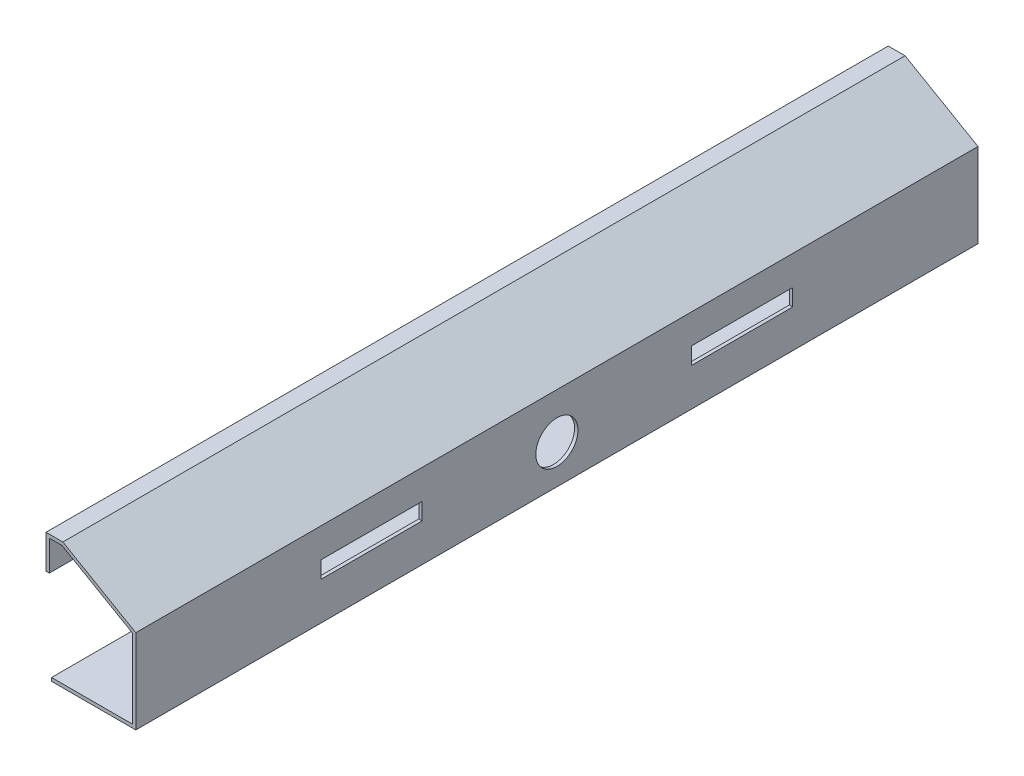
ISO-10303-21;
HEADER;
FILE_DESCRIPTION(('STEP AP214'),'2;1');
FILE_NAME('part.step','',(''),(''),'','','');
FILE_SCHEMA(('AUTOMOTIVE_DESIGN { 1 0 10303 214 1 1 1 1 }'));
ENDSEC;
DATA;
#1=APPLICATION_CONTEXT('core data for automotive mechanical design processes');
#2=APPLICATION_PROTOCOL_DEFINITION('international standard','automotive_design',2000,#1);
#3=PRODUCT_CONTEXT('',#1,'mechanical');
#4=PRODUCT('Part','Part','',(#3));
#5=PRODUCT_RELATED_PRODUCT_CATEGORY('part','',(#4));
#6=PRODUCT_DEFINITION_FORMATION('','',#4);
#7=PRODUCT_DEFINITION_CONTEXT('part definition',#1,'design');
#8=PRODUCT_DEFINITION('design','',#6,#7);
#9=PRODUCT_DEFINITION_SHAPE('','',#8);
#10=(LENGTH_UNIT() NAMED_UNIT(*) SI_UNIT(.MILLI.,.METRE.));
#11=(NAMED_UNIT(*) PLANE_ANGLE_UNIT() SI_UNIT($,.RADIAN.));
#12=(NAMED_UNIT(*) SI_UNIT($,.STERADIAN.) SOLID_ANGLE_UNIT());
#13=UNCERTAINTY_MEASURE_WITH_UNIT(LENGTH_MEASURE(1.E-05),#10,'distance_accuracy_value','');
#14=(GEOMETRIC_REPRESENTATION_CONTEXT(3) GLOBAL_UNCERTAINTY_ASSIGNED_CONTEXT((#13)) GLOBAL_UNIT_ASSIGNED_CONTEXT((#10,
#11,#12)) REPRESENTATION_CONTEXT('',''));
#15=CARTESIAN_POINT('',(0.,0.,0.));
#16=DIRECTION('',(0.,0.,1.));
#17=DIRECTION('',(1.,0.,0.));
#18=AXIS2_PLACEMENT_3D('',#15,#16,#17);
#19=CARTESIAN_POINT('',(0.,0.,500.));
#20=DIRECTION('',(-1.,0.,0.));
#21=DIRECTION('',(0.,-1.,0.));
#22=AXIS2_PLACEMENT_3D('',#19,#20,#21);
#23=PLANE('',#22);
#24=DIRECTION('',(0.,0.,1.));
#25=VECTOR('',#24,1.);
#26=CARTESIAN_POINT('',(0.,-17.5,390.));
#27=LINE('',#26,#25);
#28=CARTESIAN_POINT('',(0.,-17.5,330.));
#29=VERTEX_POINT('',#28);
#30=CARTESIAN_POINT('',(0.,-17.5,390.));
#31=VERTEX_POINT('',#30);
#32=EDGE_CURVE('E233',#29,#31,#27,.T.);
#33=ORIENTED_EDGE('',*,*,#32,.F.);
#34=DIRECTION('',(0.,1.,0.));
#35=VECTOR('',#34,1.);
#36=CARTESIAN_POINT('',(0.,-27.5,330.));
#37=LINE('',#36,#35);
#38=CARTESIAN_POINT('',(0.,-27.5,330.));
#39=VERTEX_POINT('',#38);
#40=EDGE_CURVE('E230',#39,#29,#37,.T.);
#41=ORIENTED_EDGE('',*,*,#40,.F.);
#42=DIRECTION('',(0.,0.,-1.));
#43=VECTOR('',#42,1.);
#44=CARTESIAN_POINT('',(0.,-27.5,390.));
#45=LINE('',#44,#43);
#46=CARTESIAN_POINT('',(0.,-27.5,390.));
#47=VERTEX_POINT('',#46);
#48=EDGE_CURVE('E217',#47,#39,#45,.T.);
#49=ORIENTED_EDGE('',*,*,#48,.F.);
#50=DIRECTION('',(0.,-1.,0.));
#51=VECTOR('',#50,1.);
#52=CARTESIAN_POINT('',(0.,-27.5,390.));
#53=LINE('',#52,#51);
#54=EDGE_CURVE('E238',#31,#47,#53,.T.);
#55=ORIENTED_EDGE('',*,*,#54,.F.);
#56=EDGE_LOOP('',(#33,#41,#49,#55));
#57=FACE_BOUND('',#56,.T.);
#58=DIRECTION('',(0.,0.,1.));
#59=VECTOR('',#58,1.);
#60=CARTESIAN_POINT('',(0.,-17.5,110.));
#61=LINE('',#60,#59);
#62=CARTESIAN_POINT('',(0.,-17.5,110.));
#63=VERTEX_POINT('',#62);
#64=CARTESIAN_POINT('',(0.,-17.5,170.));
#65=VERTEX_POINT('',#64);
#66=EDGE_CURVE('E278',#63,#65,#61,.T.);
#67=ORIENTED_EDGE('',*,*,#66,.F.);
#68=DIRECTION('',(0.,1.,0.));
#69=VECTOR('',#68,1.);
#70=CARTESIAN_POINT('',(0.,-27.4999999999999,110.));
#71=LINE('',#70,#69);
#72=CARTESIAN_POINT('',(0.,-27.4999999999999,110.));
#73=VERTEX_POINT('',#72);
#74=EDGE_CURVE('E211',#73,#63,#71,.T.);
#75=ORIENTED_EDGE('',*,*,#74,.F.);
#76=DIRECTION('',(0.,0.,-1.));
#77=VECTOR('',#76,1.);
#78=CARTESIAN_POINT('',(0.,-27.4999999999999,110.));
#79=LINE('',#78,#77);
#80=CARTESIAN_POINT('',(0.,-27.5,170.));
#81=VERTEX_POINT('',#80);
#82=EDGE_CURVE('E263',#81,#73,#79,.T.);
#83=ORIENTED_EDGE('',*,*,#82,.F.);
#84=DIRECTION('',(0.,-1.,0.));
#85=VECTOR('',#84,1.);
#86=CARTESIAN_POINT('',(0.,-27.5,170.));
#87=LINE('',#86,#85);
#88=EDGE_CURVE('E282',#65,#81,#87,.T.);
#89=ORIENTED_EDGE('',*,*,#88,.F.);
#90=EDGE_LOOP('',(#67,#75,#83,#89));
#91=FACE_BOUND('',#90,.T.);
#92=CARTESIAN_POINT('',(0.,-27.,250.));
#93=DIRECTION('',(1.,0.,0.));
#94=DIRECTION('',(0.,0.,-1.));
#95=AXIS2_PLACEMENT_3D('',#92,#93,#94);
#96=CIRCLE('',#95,12.5);
#97=CARTESIAN_POINT('',(0.,-27.,237.5));
#98=VERTEX_POINT('',#97);
#99=EDGE_CURVE('E248',#98,#98,#96,.T.);
#100=ORIENTED_EDGE('',*,*,#99,.F.);
#101=EDGE_LOOP('',(#100));
#102=FACE_BOUND('',#101,.T.);
#103=DIRECTION('',(0.,1.,0.));
#104=VECTOR('',#103,1.);
#105=CARTESIAN_POINT('',(0.,0.,0.));
#106=LINE('',#105,#104);
#107=CARTESIAN_POINT('',(0.,-50.,0.));
#108=VERTEX_POINT('',#107);
#109=CARTESIAN_POINT('',(0.,0.,0.));
#110=VERTEX_POINT('',#109);
#111=EDGE_CURVE('E335',#108,#110,#106,.T.);
#112=ORIENTED_EDGE('',*,*,#111,.T.);
#113=DIRECTION('',(0.,0.,-1.));
#114=VECTOR('',#113,1.);
#115=CARTESIAN_POINT('',(0.,0.,500.));
#116=LINE('',#115,#114);
#117=CARTESIAN_POINT('',(0.,0.,500.));
#118=VERTEX_POINT('',#117);
#119=EDGE_CURVE('E11',#118,#110,#116,.T.);
#120=ORIENTED_EDGE('',*,*,#119,.F.);
#121=DIRECTION('',(0.,1.,0.));
#122=VECTOR('',#121,1.);
#123=CARTESIAN_POINT('',(0.,0.,500.));
#124=LINE('',#123,#122);
#125=CARTESIAN_POINT('',(0.,-50.,500.));
#126=VERTEX_POINT('',#125);
#127=EDGE_CURVE('E303',#126,#118,#124,.T.);
#128=ORIENTED_EDGE('',*,*,#127,.F.);
#129=DIRECTION('',(0.,0.,-1.));
#130=VECTOR('',#129,1.);
#131=CARTESIAN_POINT('',(0.,-50.,500.));
#132=LINE('',#131,#130);
#133=EDGE_CURVE('E334',#126,#108,#132,.T.);
#134=ORIENTED_EDGE('',*,*,#133,.T.);
#135=EDGE_LOOP('',(#112,#120,#128,#134));
#136=FACE_BOUND('',#135,.T.);
#137=ADVANCED_FACE('F39',(#57,#91,#102,#136),#23,.F.);
#138=CARTESIAN_POINT('',(0.,0.,500.));
#139=DIRECTION('',(-0.500000000000004,-0.866025403784436,0.));
#140=DIRECTION('',(0.866025403784436,-0.500000000000004,0.));
#141=AXIS2_PLACEMENT_3D('',#138,#139,#140);
#142=PLANE('',#141);
#143=DIRECTION('',(-0.866025403784436,0.500000000000004,0.));
#144=VECTOR('',#143,1.);
#145=CARTESIAN_POINT('',(0.,0.,0.));
#146=LINE('',#145,#144);
#147=CARTESIAN_POINT('',(-43.3012701892218,25.0000000000002,0.));
#148=VERTEX_POINT('',#147);
#149=EDGE_CURVE('E339',#110,#148,#146,.T.);
#150=ORIENTED_EDGE('',*,*,#149,.T.);
#151=DIRECTION('',(0.,0.,-1.));
#152=VECTOR('',#151,1.);
#153=CARTESIAN_POINT('',(-43.3012701892218,25.0000000000002,500.));
#154=LINE('',#153,#152);
#155=CARTESIAN_POINT('',(-43.3012701892218,25.0000000000002,500.));
#156=VERTEX_POINT('',#155);
#157=EDGE_CURVE('E48',#156,#148,#154,.T.);
#158=ORIENTED_EDGE('',*,*,#157,.F.);
#159=DIRECTION('',(-0.866025403784436,0.500000000000004,0.));
#160=VECTOR('',#159,1.);
#161=CARTESIAN_POINT('',(0.,0.,500.));
#162=LINE('',#161,#160);
#163=EDGE_CURVE('E307',#118,#156,#162,.T.);
#164=ORIENTED_EDGE('',*,*,#163,.F.);
#165=ORIENTED_EDGE('',*,*,#119,.T.);
#166=EDGE_LOOP('',(#150,#158,#164,#165));
#167=FACE_BOUND('',#166,.T.);
#168=ADVANCED_FACE('F408',(#167),#142,.F.);
#169=CARTESIAN_POINT('',(-43.3012701892218,25.0000000000002,500.));
#170=DIRECTION('',(0.,-1.,0.));
#171=DIRECTION('',(1.,0.,0.));
#172=AXIS2_PLACEMENT_3D('',#169,#170,#171);
#173=PLANE('',#172);
#174=DIRECTION('',(-1.,0.,0.));
#175=VECTOR('',#174,1.);
#176=CARTESIAN_POINT('',(-43.3012701892218,25.0000000000002,0.));
#177=LINE('',#176,#175);
#178=CARTESIAN_POINT('',(-53.3012701892218,25.0000000000002,0.));
#179=VERTEX_POINT('',#178);
#180=EDGE_CURVE('E342',#148,#179,#177,.T.);
#181=ORIENTED_EDGE('',*,*,#180,.T.);
#182=DIRECTION('',(0.,0.,-1.));
#183=VECTOR('',#182,1.);
#184=CARTESIAN_POINT('',(-53.3012701892218,25.0000000000002,500.));
#185=LINE('',#184,#183);
#186=CARTESIAN_POINT('',(-53.3012701892218,25.0000000000002,500.));
#187=VERTEX_POINT('',#186);
#188=EDGE_CURVE('E387',#187,#179,#185,.T.);
#189=ORIENTED_EDGE('',*,*,#188,.F.);
#190=DIRECTION('',(-1.,0.,0.));
#191=VECTOR('',#190,1.);
#192=CARTESIAN_POINT('',(-43.3012701892218,25.0000000000002,500.));
#193=LINE('',#192,#191);
#194=EDGE_CURVE('E311',#156,#187,#193,.T.);
#195=ORIENTED_EDGE('',*,*,#194,.F.);
#196=ORIENTED_EDGE('',*,*,#157,.T.);
#197=EDGE_LOOP('',(#181,#189,#195,#196));
#198=FACE_BOUND('',#197,.T.);
#199=ADVANCED_FACE('F397',(#198),#173,.F.);
#200=CARTESIAN_POINT('',(-53.3012701892218,25.0000000000002,500.));
#201=DIRECTION('',(1.,0.,0.));
#202=DIRECTION('',(0.,0.,-1.));
#203=AXIS2_PLACEMENT_3D('',#200,#201,#202);
#204=PLANE('',#203);
#205=DIRECTION('',(0.,-1.,0.));
#206=VECTOR('',#205,1.);
#207=CARTESIAN_POINT('',(-53.3012701892218,25.0000000000002,0.));
#208=LINE('',#207,#206);
#209=CARTESIAN_POINT('',(-53.3012701892218,5.00000000000018,0.));
#210=VERTEX_POINT('',#209);
#211=EDGE_CURVE('E345',#179,#210,#208,.T.);
#212=ORIENTED_EDGE('',*,*,#211,.T.);
#213=DIRECTION('',(0.,0.,1.));
#214=VECTOR('',#213,1.);
#215=CARTESIAN_POINT('',(-53.3012701892218,5.00000000000018,0.));
#216=LINE('',#215,#214);
#217=CARTESIAN_POINT('',(-53.3012701892218,5.00000000000018,500.));
#218=VERTEX_POINT('',#217);
#219=EDGE_CURVE('E194',#210,#218,#216,.T.);
#220=ORIENTED_EDGE('',*,*,#219,.T.);
#221=DIRECTION('',(0.,-1.,0.));
#222=VECTOR('',#221,1.);
#223=CARTESIAN_POINT('',(-53.3012701892218,25.0000000000002,500.));
#224=LINE('',#223,#222);
#225=EDGE_CURVE('E314',#187,#218,#224,.T.);
#226=ORIENTED_EDGE('',*,*,#225,.F.);
#227=ORIENTED_EDGE('',*,*,#188,.T.);
#228=EDGE_LOOP('',(#212,#220,#226,#227));
#229=FACE_BOUND('',#228,.T.);
#230=ADVANCED_FACE('F402',(#229),#204,.F.);
#231=CARTESIAN_POINT('',(-43.8371685740841,23.0000000000002,500.));
#232=DIRECTION('',(0.,1.,0.));
#233=DIRECTION('',(0.,0.,1.));
#234=AXIS2_PLACEMENT_3D('',#231,#232,#233);
#235=PLANE('',#234);
#236=DIRECTION('',(1.,0.,0.));
#237=VECTOR('',#236,1.);
#238=CARTESIAN_POINT('',(-43.8371685740841,23.0000000000002,500.));
#239=LINE('',#238,#237);
#240=CARTESIAN_POINT('',(-51.3012701892218,23.0000000000002,500.));
#241=VERTEX_POINT('',#240);
#242=CARTESIAN_POINT('',(-43.8371685740841,23.0000000000002,500.));
#243=VERTEX_POINT('',#242);
#244=EDGE_CURVE('E55',#241,#243,#239,.T.);
#245=ORIENTED_EDGE('',*,*,#244,.F.);
#246=DIRECTION('',(0.,0.,-1.));
#247=VECTOR('',#246,1.);
#248=CARTESIAN_POINT('',(-51.3012701892218,23.0000000000002,500.));
#249=LINE('',#248,#247);
#250=CARTESIAN_POINT('',(-51.3012701892218,23.0000000000002,0.));
#251=VERTEX_POINT('',#250);
#252=EDGE_CURVE('E59',#241,#251,#249,.T.);
#253=ORIENTED_EDGE('',*,*,#252,.T.);
#254=DIRECTION('',(1.,0.,0.));
#255=VECTOR('',#254,1.);
#256=CARTESIAN_POINT('',(-43.8371685740841,23.0000000000002,0.));
#257=LINE('',#256,#255);
#258=CARTESIAN_POINT('',(-43.8371685740841,23.0000000000002,0.));
#259=VERTEX_POINT('',#258);
#260=EDGE_CURVE('E182',#251,#259,#257,.T.);
#261=ORIENTED_EDGE('',*,*,#260,.T.);
#262=DIRECTION('',(0.,0.,-1.));
#263=VECTOR('',#262,1.);
#264=CARTESIAN_POINT('',(-43.8371685740841,23.0000000000002,500.));
#265=LINE('',#264,#263);
#266=EDGE_CURVE('E383',#243,#259,#265,.T.);
#267=ORIENTED_EDGE('',*,*,#266,.F.);
#268=EDGE_LOOP('',(#245,#253,#261,#267));
#269=FACE_BOUND('',#268,.T.);
#270=ADVANCED_FACE('F434',(#269),#235,.F.);
#271=CARTESIAN_POINT('',(-2.,-1.15470053837925,500.));
#272=DIRECTION('',(0.500000000000004,0.866025403784436,0.));
#273=DIRECTION('',(-0.866025403784436,0.500000000000004,0.));
#274=AXIS2_PLACEMENT_3D('',#271,#272,#273);
#275=PLANE('',#274);
#276=DIRECTION('',(0.866025403784436,-0.500000000000004,0.));
#277=VECTOR('',#276,1.);
#278=CARTESIAN_POINT('',(-2.,-1.15470053837925,0.));
#279=LINE('',#278,#277);
#280=CARTESIAN_POINT('',(-2.,-1.15470053837925,0.));
#281=VERTEX_POINT('',#280);
#282=EDGE_CURVE('E350',#259,#281,#279,.T.);
#283=ORIENTED_EDGE('',*,*,#282,.T.);
#284=DIRECTION('',(0.,0.,-1.));
#285=VECTOR('',#284,1.);
#286=CARTESIAN_POINT('',(-2.,-1.15470053837925,500.));
#287=LINE('',#286,#285);
#288=CARTESIAN_POINT('',(-2.,-1.15470053837925,500.));
#289=VERTEX_POINT('',#288);
#290=EDGE_CURVE('E379',#289,#281,#287,.T.);
#291=ORIENTED_EDGE('',*,*,#290,.F.);
#292=DIRECTION('',(0.866025403784436,-0.500000000000004,0.));
#293=VECTOR('',#292,1.);
#294=CARTESIAN_POINT('',(-2.,-1.15470053837925,500.));
#295=LINE('',#294,#293);
#296=EDGE_CURVE('E319',#243,#289,#295,.T.);
#297=ORIENTED_EDGE('',*,*,#296,.F.);
#298=ORIENTED_EDGE('',*,*,#266,.T.);
#299=EDGE_LOOP('',(#283,#291,#297,#298));
#300=FACE_BOUND('',#299,.T.);
#301=ADVANCED_FACE('F433',(#300),#275,.F.);
#302=CARTESIAN_POINT('',(-2.,-1.15470053837925,500.));
#303=DIRECTION('',(1.,0.,0.));
#304=DIRECTION('',(0.,1.,0.));
#305=AXIS2_PLACEMENT_3D('',#302,#303,#304);
#306=PLANE('',#305);
#307=DIRECTION('',(0.,0.,-1.));
#308=VECTOR('',#307,1.);
#309=CARTESIAN_POINT('',(-2.,-27.5,390.));
#310=LINE('',#309,#308);
#311=CARTESIAN_POINT('',(-2.,-27.5,390.));
#312=VERTEX_POINT('',#311);
#313=CARTESIAN_POINT('',(-2.,-27.5,330.));
#314=VERTEX_POINT('',#313);
#315=EDGE_CURVE('E225',#312,#314,#310,.T.);
#316=ORIENTED_EDGE('',*,*,#315,.T.);
#317=DIRECTION('',(0.,1.,0.));
#318=VECTOR('',#317,1.);
#319=CARTESIAN_POINT('',(-2.,-27.5,330.));
#320=LINE('',#319,#318);
#321=CARTESIAN_POINT('',(-2.,-17.5,330.));
#322=VERTEX_POINT('',#321);
#323=EDGE_CURVE('E212',#314,#322,#320,.T.);
#324=ORIENTED_EDGE('',*,*,#323,.T.);
#325=DIRECTION('',(0.,0.,1.));
#326=VECTOR('',#325,1.);
#327=CARTESIAN_POINT('',(-2.,-17.5,390.));
#328=LINE('',#327,#326);
#329=CARTESIAN_POINT('',(-2.,-17.5,390.));
#330=VERTEX_POINT('',#329);
#331=EDGE_CURVE('E216',#322,#330,#328,.T.);
#332=ORIENTED_EDGE('',*,*,#331,.T.);
#333=DIRECTION('',(0.,-1.,0.));
#334=VECTOR('',#333,1.);
#335=CARTESIAN_POINT('',(-2.,-27.5,390.));
#336=LINE('',#335,#334);
#337=EDGE_CURVE('E221',#330,#312,#336,.T.);
#338=ORIENTED_EDGE('',*,*,#337,.T.);
#339=EDGE_LOOP('',(#316,#324,#332,#338));
#340=FACE_BOUND('',#339,.T.);
#341=DIRECTION('',(0.,0.,-1.));
#342=VECTOR('',#341,1.);
#343=CARTESIAN_POINT('',(-2.,-27.4999999999999,110.));
#344=LINE('',#343,#342);
#345=CARTESIAN_POINT('',(-2.,-27.5,170.));
#346=VERTEX_POINT('',#345);
#347=CARTESIAN_POINT('',(-2.,-27.4999999999999,110.));
#348=VERTEX_POINT('',#347);
#349=EDGE_CURVE('E271',#346,#348,#344,.T.);
#350=ORIENTED_EDGE('',*,*,#349,.T.);
#351=DIRECTION('',(0.,1.,0.));
#352=VECTOR('',#351,1.);
#353=CARTESIAN_POINT('',(-2.,-27.4999999999999,110.));
#354=LINE('',#353,#352);
#355=CARTESIAN_POINT('',(-2.,-17.5,110.));
#356=VERTEX_POINT('',#355);
#357=EDGE_CURVE('E258',#348,#356,#354,.T.);
#358=ORIENTED_EDGE('',*,*,#357,.T.);
#359=DIRECTION('',(0.,0.,1.));
#360=VECTOR('',#359,1.);
#361=CARTESIAN_POINT('',(-2.,-17.5,110.));
#362=LINE('',#361,#360);
#363=CARTESIAN_POINT('',(-2.,-17.5,170.));
#364=VERTEX_POINT('',#363);
#365=EDGE_CURVE('E262',#356,#364,#362,.T.);
#366=ORIENTED_EDGE('',*,*,#365,.T.);
#367=DIRECTION('',(0.,-1.,0.));
#368=VECTOR('',#367,1.);
#369=CARTESIAN_POINT('',(-2.,-27.5,170.));
#370=LINE('',#369,#368);
#371=EDGE_CURVE('E267',#364,#346,#370,.T.);
#372=ORIENTED_EDGE('',*,*,#371,.T.);
#373=EDGE_LOOP('',(#350,#358,#366,#372));
#374=FACE_BOUND('',#373,.T.);
#375=CARTESIAN_POINT('',(-2.,-27.,250.));
#376=DIRECTION('',(1.,0.,0.));
#377=DIRECTION('',(0.,1.,0.));
#378=AXIS2_PLACEMENT_3D('',#375,#376,#377);
#379=CIRCLE('',#378,12.5);
#380=CARTESIAN_POINT('',(-2.,-14.5,250.));
#381=VERTEX_POINT('',#380);
#382=EDGE_CURVE('E42',#381,#381,#379,.T.);
#383=ORIENTED_EDGE('',*,*,#382,.T.);
#384=EDGE_LOOP('',(#383));
#385=FACE_BOUND('',#384,.T.);
#386=DIRECTION('',(0.,-1.,0.));
#387=VECTOR('',#386,1.);
#388=CARTESIAN_POINT('',(-2.,-1.15470053837925,0.));
#389=LINE('',#388,#387);
#390=CARTESIAN_POINT('',(-1.99999999999999,-48.,0.));
#391=VERTEX_POINT('',#390);
#392=EDGE_CURVE('E353',#281,#391,#389,.T.);
#393=ORIENTED_EDGE('',*,*,#392,.T.);
#394=DIRECTION('',(0.,0.,-1.));
#395=VECTOR('',#394,1.);
#396=CARTESIAN_POINT('',(-1.99999999999999,-48.,500.));
#397=LINE('',#396,#395);
#398=CARTESIAN_POINT('',(-1.99999999999999,-48.,500.));
#399=VERTEX_POINT('',#398);
#400=EDGE_CURVE('E375',#399,#391,#397,.T.);
#401=ORIENTED_EDGE('',*,*,#400,.F.);
#402=DIRECTION('',(0.,-1.,0.));
#403=VECTOR('',#402,1.);
#404=CARTESIAN_POINT('',(-2.,-1.15470053837925,500.));
#405=LINE('',#404,#403);
#406=EDGE_CURVE('E322',#289,#399,#405,.T.);
#407=ORIENTED_EDGE('',*,*,#406,.F.);
#408=ORIENTED_EDGE('',*,*,#290,.T.);
#409=EDGE_LOOP('',(#393,#401,#407,#408));
#410=FACE_BOUND('',#409,.T.);
#411=ADVANCED_FACE('F428',(#340,#374,#385,#410),#306,.F.);
#412=CARTESIAN_POINT('',(-1.99999999999999,-48.,500.));
#413=DIRECTION('',(0.,-1.,0.));
#414=DIRECTION('',(1.,0.,0.));
#415=AXIS2_PLACEMENT_3D('',#412,#413,#414);
#416=PLANE('',#415);
#417=DIRECTION('',(-1.,0.,0.));
#418=VECTOR('',#417,1.);
#419=CARTESIAN_POINT('',(-1.99999999999999,-48.,0.));
#420=LINE('',#419,#418);
#421=CARTESIAN_POINT('',(-50.,-48.,0.));
#422=VERTEX_POINT('',#421);
#423=EDGE_CURVE('E356',#391,#422,#420,.T.);
#424=ORIENTED_EDGE('',*,*,#423,.T.);
#425=DIRECTION('',(0.,0.,-1.));
#426=VECTOR('',#425,1.);
#427=CARTESIAN_POINT('',(-50.,-48.,500.));
#428=LINE('',#427,#426);
#429=CARTESIAN_POINT('',(-50.,-48.,500.));
#430=VERTEX_POINT('',#429);
#431=EDGE_CURVE('E371',#430,#422,#428,.T.);
#432=ORIENTED_EDGE('',*,*,#431,.F.);
#433=DIRECTION('',(-1.,0.,0.));
#434=VECTOR('',#433,1.);
#435=CARTESIAN_POINT('',(-1.99999999999999,-48.,500.));
#436=LINE('',#435,#434);
#437=EDGE_CURVE('E325',#399,#430,#436,.T.);
#438=ORIENTED_EDGE('',*,*,#437,.F.);
#439=ORIENTED_EDGE('',*,*,#400,.T.);
#440=EDGE_LOOP('',(#424,#432,#438,#439));
#441=FACE_BOUND('',#440,.T.);
#442=ADVANCED_FACE('F424',(#441),#416,.F.);
#443=CARTESIAN_POINT('',(-50.,-48.,500.));
#444=DIRECTION('',(1.,0.,0.));
#445=DIRECTION('',(0.,0.,-1.));
#446=AXIS2_PLACEMENT_3D('',#443,#444,#445);
#447=PLANE('',#446);
#448=DIRECTION('',(0.,-1.,0.));
#449=VECTOR('',#448,1.);
#450=CARTESIAN_POINT('',(-50.,-48.,0.));
#451=LINE('',#450,#449);
#452=CARTESIAN_POINT('',(-50.,-50.,0.));
#453=VERTEX_POINT('',#452);
#454=EDGE_CURVE('E359',#422,#453,#451,.T.);
#455=ORIENTED_EDGE('',*,*,#454,.T.);
#456=DIRECTION('',(0.,0.,-1.));
#457=VECTOR('',#456,1.);
#458=CARTESIAN_POINT('',(-50.,-50.,500.));
#459=LINE('',#458,#457);
#460=CARTESIAN_POINT('',(-50.,-50.,500.));
#461=VERTEX_POINT('',#460);
#462=EDGE_CURVE('E367',#461,#453,#459,.T.);
#463=ORIENTED_EDGE('',*,*,#462,.F.);
#464=DIRECTION('',(0.,-1.,0.));
#465=VECTOR('',#464,1.);
#466=CARTESIAN_POINT('',(-50.,-48.,500.));
#467=LINE('',#466,#465);
#468=EDGE_CURVE('E328',#430,#461,#467,.T.);
#469=ORIENTED_EDGE('',*,*,#468,.F.);
#470=ORIENTED_EDGE('',*,*,#431,.T.);
#471=EDGE_LOOP('',(#455,#463,#469,#470));
#472=FACE_BOUND('',#471,.T.);
#473=ADVANCED_FACE('F420',(#472),#447,.F.);
#474=CARTESIAN_POINT('',(0.,-50.,500.));
#475=DIRECTION('',(0.,1.,0.));
#476=DIRECTION('',(-1.,0.,0.));
#477=AXIS2_PLACEMENT_3D('',#474,#475,#476);
#478=PLANE('',#477);
#479=DIRECTION('',(1.,0.,0.));
#480=VECTOR('',#479,1.);
#481=CARTESIAN_POINT('',(0.,-50.,0.));
#482=LINE('',#481,#480);
#483=EDGE_CURVE('E308',#453,#108,#482,.T.);
#484=ORIENTED_EDGE('',*,*,#483,.T.);
#485=ORIENTED_EDGE('',*,*,#133,.F.);
#486=DIRECTION('',(1.,0.,0.));
#487=VECTOR('',#486,1.);
#488=CARTESIAN_POINT('',(0.,-50.,500.));
#489=LINE('',#488,#487);
#490=EDGE_CURVE('E331',#461,#126,#489,.T.);
#491=ORIENTED_EDGE('',*,*,#490,.F.);
#492=ORIENTED_EDGE('',*,*,#462,.T.);
#493=EDGE_LOOP('',(#484,#485,#491,#492));
#494=FACE_BOUND('',#493,.T.);
#495=ADVANCED_FACE('F415',(#494),#478,.F.);
#496=CARTESIAN_POINT('',(0.,0.,500.));
#497=DIRECTION('',(0.,0.,-1.));
#498=DIRECTION('',(-1.,0.,0.));
#499=AXIS2_PLACEMENT_3D('',#496,#497,#498);
#500=PLANE('',#499);
#501=ORIENTED_EDGE('',*,*,#194,.T.);
#502=ORIENTED_EDGE('',*,*,#225,.T.);
#503=DIRECTION('',(-1.,0.,0.));
#504=VECTOR('',#503,1.);
#505=CARTESIAN_POINT('',(-51.3012701892218,5.00000000000018,500.));
#506=LINE('',#505,#504);
#507=CARTESIAN_POINT('',(-51.3012701892218,5.00000000000018,500.));
#508=VERTEX_POINT('',#507);
#509=EDGE_CURVE('E196',#508,#218,#506,.T.);
#510=ORIENTED_EDGE('',*,*,#509,.F.);
#511=DIRECTION('',(0.,1.,0.));
#512=VECTOR('',#511,1.);
#513=CARTESIAN_POINT('',(-51.3012701892218,5.00000000000018,500.));
#514=LINE('',#513,#512);
#515=EDGE_CURVE('E187',#508,#241,#514,.T.);
#516=ORIENTED_EDGE('',*,*,#515,.T.);
#517=ORIENTED_EDGE('',*,*,#244,.T.);
#518=ORIENTED_EDGE('',*,*,#296,.T.);
#519=ORIENTED_EDGE('',*,*,#406,.T.);
#520=ORIENTED_EDGE('',*,*,#437,.T.);
#521=ORIENTED_EDGE('',*,*,#468,.T.);
#522=ORIENTED_EDGE('',*,*,#490,.T.);
#523=ORIENTED_EDGE('',*,*,#127,.T.);
#524=ORIENTED_EDGE('',*,*,#163,.T.);
#525=EDGE_LOOP('',(#501,#502,#510,#516,#517,#518,#519,#520,#521,#522,#523,#524));
#526=FACE_BOUND('',#525,.T.);
#527=ADVANCED_FACE('F405',(#526),#500,.F.);
#528=CARTESIAN_POINT('',(0.,0.,0.));
#529=DIRECTION('',(0.,0.,-1.));
#530=DIRECTION('',(-1.,0.,0.));
#531=AXIS2_PLACEMENT_3D('',#528,#529,#530);
#532=PLANE('',#531);
#533=ORIENTED_EDGE('',*,*,#260,.F.);
#534=DIRECTION('',(0.,-1.,0.));
#535=VECTOR('',#534,1.);
#536=CARTESIAN_POINT('',(-51.3012701892218,5.00000000000018,0.));
#537=LINE('',#536,#535);
#538=CARTESIAN_POINT('',(-51.3012701892218,5.00000000000018,0.));
#539=VERTEX_POINT('',#538);
#540=EDGE_CURVE('E175',#251,#539,#537,.T.);
#541=ORIENTED_EDGE('',*,*,#540,.T.);
#542=DIRECTION('',(-1.,0.,0.));
#543=VECTOR('',#542,1.);
#544=CARTESIAN_POINT('',(-51.3012701892218,5.00000000000018,0.));
#545=LINE('',#544,#543);
#546=EDGE_CURVE('E179',#539,#210,#545,.T.);
#547=ORIENTED_EDGE('',*,*,#546,.T.);
#548=ORIENTED_EDGE('',*,*,#211,.F.);
#549=ORIENTED_EDGE('',*,*,#180,.F.);
#550=ORIENTED_EDGE('',*,*,#149,.F.);
#551=ORIENTED_EDGE('',*,*,#111,.F.);
#552=ORIENTED_EDGE('',*,*,#483,.F.);
#553=ORIENTED_EDGE('',*,*,#454,.F.);
#554=ORIENTED_EDGE('',*,*,#423,.F.);
#555=ORIENTED_EDGE('',*,*,#392,.F.);
#556=ORIENTED_EDGE('',*,*,#282,.F.);
#557=EDGE_LOOP('',(#533,#541,#547,#548,#549,#550,#551,#552,#553,#554,#555,#556));
#558=FACE_BOUND('',#557,.T.);
#559=ADVANCED_FACE('F177',(#558),#532,.T.);
#560=CARTESIAN_POINT('',(-53.3012701892218,-27.,250.));
#561=DIRECTION('',(1.,0.,0.));
#562=DIRECTION('',(0.,0.,-1.));
#563=AXIS2_PLACEMENT_3D('',#560,#561,#562);
#564=CYLINDRICAL_SURFACE('',#563,12.5);
#565=ORIENTED_EDGE('',*,*,#99,.T.);
#566=EDGE_LOOP('',(#565));
#567=FACE_BOUND('',#566,.T.);
#568=ORIENTED_EDGE('',*,*,#382,.F.);
#569=EDGE_LOOP('',(#568));
#570=FACE_BOUND('',#569,.T.);
#571=ADVANCED_FACE('F458',(#567,#570),#564,.F.);
#572=CARTESIAN_POINT('',(-2.,-27.4999999999999,110.));
#573=DIRECTION('',(0.,0.,-1.));
#574=DIRECTION('',(-1.,0.,0.));
#575=AXIS2_PLACEMENT_3D('',#572,#573,#574);
#576=PLANE('',#575);
#577=ORIENTED_EDGE('',*,*,#74,.T.);
#578=DIRECTION('',(1.,0.,0.));
#579=VECTOR('',#578,1.);
#580=CARTESIAN_POINT('',(-2.,-17.5,110.));
#581=LINE('',#580,#579);
#582=EDGE_CURVE('E275',#356,#63,#581,.T.);
#583=ORIENTED_EDGE('',*,*,#582,.F.);
#584=ORIENTED_EDGE('',*,*,#357,.F.);
#585=DIRECTION('',(1.,0.,0.));
#586=VECTOR('',#585,1.);
#587=CARTESIAN_POINT('',(-2.,-27.4999999999999,110.));
#588=LINE('',#587,#586);
#589=EDGE_CURVE('E234',#348,#73,#588,.T.);
#590=ORIENTED_EDGE('',*,*,#589,.T.);
#591=EDGE_LOOP('',(#577,#583,#584,#590));
#592=FACE_BOUND('',#591,.T.);
#593=ADVANCED_FACE('F461',(#592),#576,.F.);
#594=CARTESIAN_POINT('',(-2.,-27.4999999999999,110.));
#595=DIRECTION('',(0.,-1.,0.));
#596=DIRECTION('',(0.,0.,-1.));
#597=AXIS2_PLACEMENT_3D('',#594,#595,#596);
#598=PLANE('',#597);
#599=ORIENTED_EDGE('',*,*,#82,.T.);
#600=ORIENTED_EDGE('',*,*,#589,.F.);
#601=ORIENTED_EDGE('',*,*,#349,.F.);
#602=DIRECTION('',(1.,0.,0.));
#603=VECTOR('',#602,1.);
#604=CARTESIAN_POINT('',(-2.,-27.5,170.));
#605=LINE('',#604,#603);
#606=EDGE_CURVE('E291',#346,#81,#605,.T.);
#607=ORIENTED_EDGE('',*,*,#606,.T.);
#608=EDGE_LOOP('',(#599,#600,#601,#607));
#609=FACE_BOUND('',#608,.T.);
#610=ADVANCED_FACE('F486',(#609),#598,.F.);
#611=CARTESIAN_POINT('',(-2.,-27.5,170.));
#612=DIRECTION('',(0.,0.,1.));
#613=DIRECTION('',(1.,0.,0.));
#614=AXIS2_PLACEMENT_3D('',#611,#612,#613);
#615=PLANE('',#614);
#616=ORIENTED_EDGE('',*,*,#88,.T.);
#617=ORIENTED_EDGE('',*,*,#606,.F.);
#618=ORIENTED_EDGE('',*,*,#371,.F.);
#619=DIRECTION('',(1.,0.,0.));
#620=VECTOR('',#619,1.);
#621=CARTESIAN_POINT('',(-2.,-17.5,170.));
#622=LINE('',#621,#620);
#623=EDGE_CURVE('E294',#364,#65,#622,.T.);
#624=ORIENTED_EDGE('',*,*,#623,.T.);
#625=EDGE_LOOP('',(#616,#617,#618,#624));
#626=FACE_BOUND('',#625,.T.);
#627=ADVANCED_FACE('F492',(#626),#615,.F.);
#628=CARTESIAN_POINT('',(-2.,-17.5,110.));
#629=DIRECTION('',(0.,1.,0.));
#630=DIRECTION('',(0.,0.,1.));
#631=AXIS2_PLACEMENT_3D('',#628,#629,#630);
#632=PLANE('',#631);
#633=ORIENTED_EDGE('',*,*,#66,.T.);
#634=ORIENTED_EDGE('',*,*,#623,.F.);
#635=ORIENTED_EDGE('',*,*,#365,.F.);
#636=ORIENTED_EDGE('',*,*,#582,.T.);
#637=EDGE_LOOP('',(#633,#634,#635,#636));
#638=FACE_BOUND('',#637,.T.);
#639=ADVANCED_FACE('F488',(#638),#632,.F.);
#640=CARTESIAN_POINT('',(-2.,-27.5,330.));
#641=DIRECTION('',(0.,0.,-1.));
#642=DIRECTION('',(-1.,0.,0.));
#643=AXIS2_PLACEMENT_3D('',#640,#641,#642);
#644=PLANE('',#643);
#645=ORIENTED_EDGE('',*,*,#40,.T.);
#646=DIRECTION('',(1.,0.,0.));
#647=VECTOR('',#646,1.);
#648=CARTESIAN_POINT('',(-2.,-17.5,330.));
#649=LINE('',#648,#647);
#650=EDGE_CURVE('E229',#322,#29,#649,.T.);
#651=ORIENTED_EDGE('',*,*,#650,.F.);
#652=ORIENTED_EDGE('',*,*,#323,.F.);
#653=DIRECTION('',(1.,0.,0.));
#654=VECTOR('',#653,1.);
#655=CARTESIAN_POINT('',(-2.,-27.5,330.));
#656=LINE('',#655,#654);
#657=EDGE_CURVE('E245',#314,#39,#656,.T.);
#658=ORIENTED_EDGE('',*,*,#657,.T.);
#659=EDGE_LOOP('',(#645,#651,#652,#658));
#660=FACE_BOUND('',#659,.T.);
#661=ADVANCED_FACE('F491',(#660),#644,.F.);
#662=CARTESIAN_POINT('',(-2.,-27.5,390.));
#663=DIRECTION('',(0.,-1.,0.));
#664=DIRECTION('',(0.,0.,-1.));
#665=AXIS2_PLACEMENT_3D('',#662,#663,#664);
#666=PLANE('',#665);
#667=ORIENTED_EDGE('',*,*,#48,.T.);
#668=ORIENTED_EDGE('',*,*,#657,.F.);
#669=ORIENTED_EDGE('',*,*,#315,.F.);
#670=DIRECTION('',(1.,0.,0.));
#671=VECTOR('',#670,1.);
#672=CARTESIAN_POINT('',(-2.,-27.5,390.));
#673=LINE('',#672,#671);
#674=EDGE_CURVE('E249',#312,#47,#673,.T.);
#675=ORIENTED_EDGE('',*,*,#674,.T.);
#676=EDGE_LOOP('',(#667,#668,#669,#675));
#677=FACE_BOUND('',#676,.T.);
#678=ADVANCED_FACE('F502',(#677),#666,.F.);
#679=CARTESIAN_POINT('',(-2.,-27.5,390.));
#680=DIRECTION('',(0.,0.,1.));
#681=DIRECTION('',(1.,0.,0.));
#682=AXIS2_PLACEMENT_3D('',#679,#680,#681);
#683=PLANE('',#682);
#684=ORIENTED_EDGE('',*,*,#54,.T.);
#685=ORIENTED_EDGE('',*,*,#674,.F.);
#686=ORIENTED_EDGE('',*,*,#337,.F.);
#687=DIRECTION('',(1.,0.,0.));
#688=VECTOR('',#687,1.);
#689=CARTESIAN_POINT('',(-2.,-17.5,390.));
#690=LINE('',#689,#688);
#691=EDGE_CURVE('E252',#330,#31,#690,.T.);
#692=ORIENTED_EDGE('',*,*,#691,.T.);
#693=EDGE_LOOP('',(#684,#685,#686,#692));
#694=FACE_BOUND('',#693,.T.);
#695=ADVANCED_FACE('F507',(#694),#683,.F.);
#696=CARTESIAN_POINT('',(-2.,-17.5,390.));
#697=DIRECTION('',(0.,1.,0.));
#698=DIRECTION('',(0.,0.,1.));
#699=AXIS2_PLACEMENT_3D('',#696,#697,#698);
#700=PLANE('',#699);
#701=ORIENTED_EDGE('',*,*,#32,.T.);
#702=ORIENTED_EDGE('',*,*,#691,.F.);
#703=ORIENTED_EDGE('',*,*,#331,.F.);
#704=ORIENTED_EDGE('',*,*,#650,.T.);
#705=EDGE_LOOP('',(#701,#702,#703,#704));
#706=FACE_BOUND('',#705,.T.);
#707=ADVANCED_FACE('F504',(#706),#700,.F.);
#708=CARTESIAN_POINT('',(-51.3012701892218,0.,0.));
#709=DIRECTION('',(1.,0.,0.));
#710=DIRECTION('',(0.,0.,-1.));
#711=AXIS2_PLACEMENT_3D('',#708,#709,#710);
#712=PLANE('',#711);
#713=ORIENTED_EDGE('',*,*,#252,.F.);
#714=ORIENTED_EDGE('',*,*,#515,.F.);
#715=DIRECTION('',(0.,0.,1.));
#716=VECTOR('',#715,1.);
#717=CARTESIAN_POINT('',(-51.3012701892218,5.00000000000018,0.));
#718=LINE('',#717,#716);
#719=EDGE_CURVE('E186',#539,#508,#718,.T.);
#720=ORIENTED_EDGE('',*,*,#719,.F.);
#721=ORIENTED_EDGE('',*,*,#540,.F.);
#722=EDGE_LOOP('',(#713,#714,#720,#721));
#723=FACE_BOUND('',#722,.T.);
#724=ADVANCED_FACE('F199',(#723),#712,.T.);
#725=CARTESIAN_POINT('',(-51.3012701892218,5.00000000000018,0.));
#726=DIRECTION('',(0.,-1.,0.));
#727=DIRECTION('',(0.,0.,-1.));
#728=AXIS2_PLACEMENT_3D('',#725,#726,#727);
#729=PLANE('',#728);
#730=ORIENTED_EDGE('',*,*,#219,.F.);
#731=ORIENTED_EDGE('',*,*,#546,.F.);
#732=ORIENTED_EDGE('',*,*,#719,.T.);
#733=ORIENTED_EDGE('',*,*,#509,.T.);
#734=EDGE_LOOP('',(#730,#731,#732,#733));
#735=FACE_BOUND('',#734,.T.);
#736=ADVANCED_FACE('F191',(#735),#729,.T.);
#737=CLOSED_SHELL('',(#137,#168,#199,#230,#270,#301,#411,#442,#473,#495,#527,#559,#571,#593,
#610,#627,#639,#661,#678,#695,#707,#724,#736));
#738=MANIFOLD_SOLID_BREP('B2',#737);
#739=ADVANCED_BREP_SHAPE_REPRESENTATION('',(#18,#738),#14);
#740=SHAPE_DEFINITION_REPRESENTATION(#9,#739);
ENDSEC;
END-ISO-10303-21;
